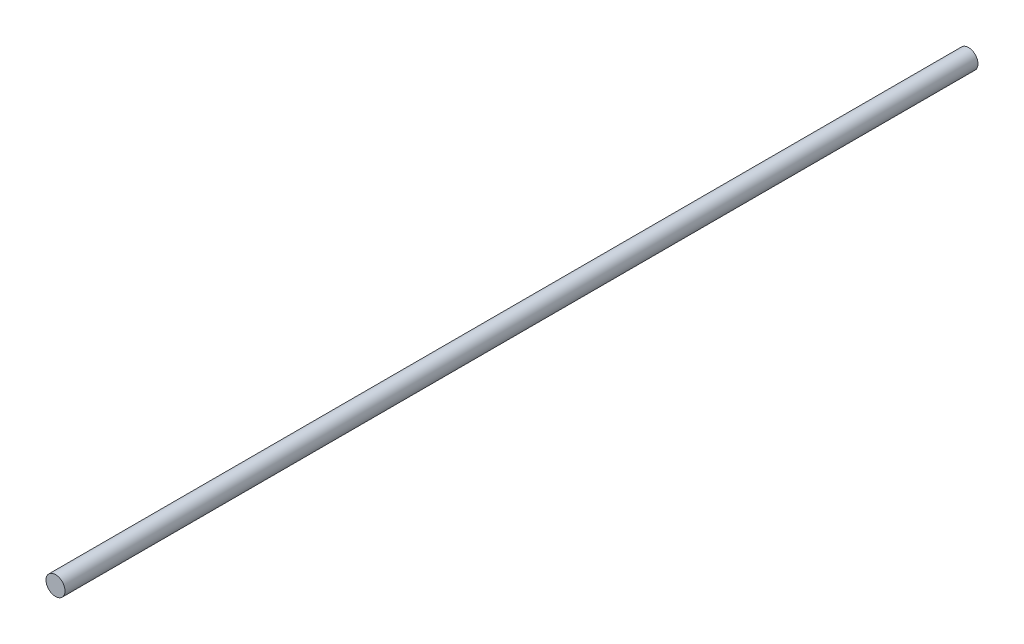
ISO-10303-21;
HEADER;
FILE_DESCRIPTION(('STEP AP214'),'2;1');
FILE_NAME('part.step','',(''),(''),'','','');
FILE_SCHEMA(('AUTOMOTIVE_DESIGN { 1 0 10303 214 1 1 1 1 }'));
ENDSEC;
DATA;
#1=APPLICATION_CONTEXT('core data for automotive mechanical design processes');
#2=APPLICATION_PROTOCOL_DEFINITION('international standard','automotive_design',2000,#1);
#3=PRODUCT_CONTEXT('',#1,'mechanical');
#4=PRODUCT('Part','Part','',(#3));
#5=PRODUCT_RELATED_PRODUCT_CATEGORY('part','',(#4));
#6=PRODUCT_DEFINITION_FORMATION('','',#4);
#7=PRODUCT_DEFINITION_CONTEXT('part definition',#1,'design');
#8=PRODUCT_DEFINITION('design','',#6,#7);
#9=PRODUCT_DEFINITION_SHAPE('','',#8);
#10=(LENGTH_UNIT() NAMED_UNIT(*) SI_UNIT(.MILLI.,.METRE.));
#11=(NAMED_UNIT(*) PLANE_ANGLE_UNIT() SI_UNIT($,.RADIAN.));
#12=(NAMED_UNIT(*) SI_UNIT($,.STERADIAN.) SOLID_ANGLE_UNIT());
#13=UNCERTAINTY_MEASURE_WITH_UNIT(LENGTH_MEASURE(1.E-05),#10,'distance_accuracy_value','');
#14=(GEOMETRIC_REPRESENTATION_CONTEXT(3) GLOBAL_UNCERTAINTY_ASSIGNED_CONTEXT((#13)) GLOBAL_UNIT_ASSIGNED_CONTEXT((#10,
#11,#12)) REPRESENTATION_CONTEXT('',''));
#15=CARTESIAN_POINT('',(0.,0.,0.));
#16=DIRECTION('',(0.,0.,1.));
#17=DIRECTION('',(1.,0.,0.));
#18=AXIS2_PLACEMENT_3D('',#15,#16,#17);
#19=CARTESIAN_POINT('',(0.,0.,152.4));
#20=DIRECTION('',(0.,0.,-1.));
#21=DIRECTION('',(-1.,0.,0.));
#22=AXIS2_PLACEMENT_3D('',#19,#20,#21);
#23=CYLINDRICAL_SURFACE('',#22,3.175);
#24=CARTESIAN_POINT('',(0.,0.,152.4));
#25=DIRECTION('',(0.,0.,1.));
#26=DIRECTION('',(1.,0.,0.));
#27=AXIS2_PLACEMENT_3D('',#24,#25,#26);
#28=CIRCLE('',#27,3.175);
#29=CARTESIAN_POINT('',(3.175,0.,152.4));
#30=VERTEX_POINT('',#29);
#31=EDGE_CURVE('E10',#30,#30,#28,.T.);
#32=ORIENTED_EDGE('',*,*,#31,.F.);
#33=EDGE_LOOP('',(#32));
#34=FACE_BOUND('',#33,.T.);
#35=CARTESIAN_POINT('',(0.,0.,-152.4));
#36=DIRECTION('',(0.,0.,1.));
#37=DIRECTION('',(1.,0.,0.));
#38=AXIS2_PLACEMENT_3D('',#35,#36,#37);
#39=CIRCLE('',#38,3.175);
#40=CARTESIAN_POINT('',(3.175,0.,-152.4));
#41=VERTEX_POINT('',#40);
#42=EDGE_CURVE('E31',#41,#41,#39,.T.);
#43=ORIENTED_EDGE('',*,*,#42,.T.);
#44=EDGE_LOOP('',(#43));
#45=FACE_BOUND('',#44,.T.);
#46=ADVANCED_FACE('F28',(#34,#45),#23,.T.);
#47=CARTESIAN_POINT('',(0.,0.,152.4));
#48=DIRECTION('',(0.,0.,1.));
#49=DIRECTION('',(1.,0.,0.));
#50=AXIS2_PLACEMENT_3D('',#47,#48,#49);
#51=PLANE('',#50);
#52=ORIENTED_EDGE('',*,*,#31,.T.);
#53=EDGE_LOOP('',(#52));
#54=FACE_BOUND('',#53,.T.);
#55=ADVANCED_FACE('F43',(#54),#51,.T.);
#56=CARTESIAN_POINT('',(0.,0.,-152.4));
#57=DIRECTION('',(0.,0.,1.));
#58=DIRECTION('',(1.,0.,0.));
#59=AXIS2_PLACEMENT_3D('',#56,#57,#58);
#60=PLANE('',#59);
#61=ORIENTED_EDGE('',*,*,#42,.F.);
#62=EDGE_LOOP('',(#61));
#63=FACE_BOUND('',#62,.T.);
#64=ADVANCED_FACE('F41',(#63),#60,.F.);
#65=CLOSED_SHELL('',(#46,#55,#64));
#66=MANIFOLD_SOLID_BREP('B2',#65);
#67=ADVANCED_BREP_SHAPE_REPRESENTATION('',(#18,#66),#14);
#68=SHAPE_DEFINITION_REPRESENTATION(#9,#67);
ENDSEC;
END-ISO-10303-21;
